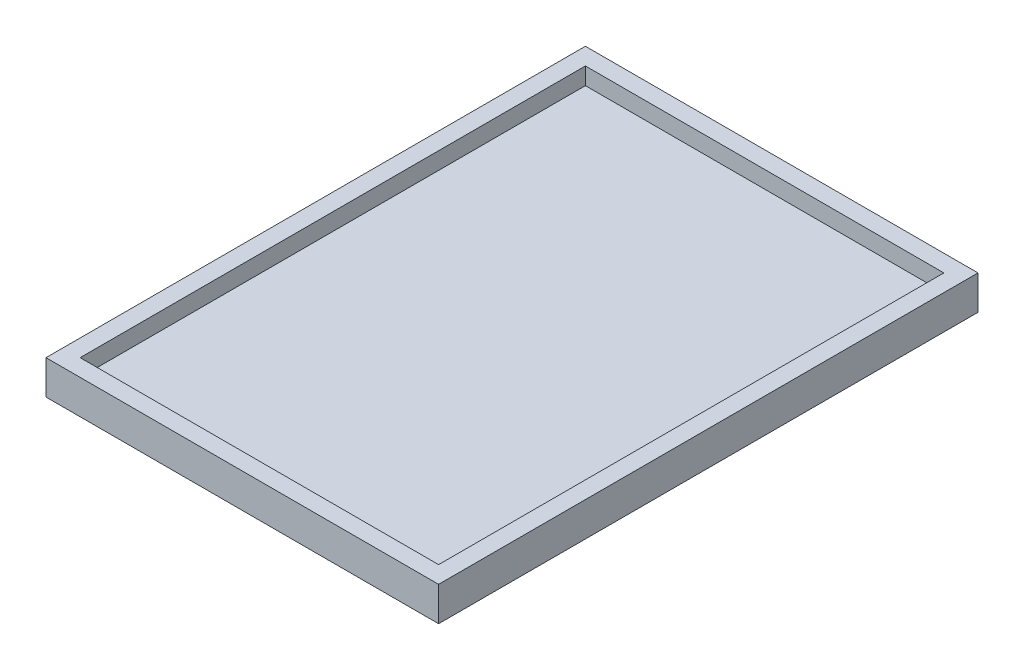
ISO-10303-21;
HEADER;
FILE_DESCRIPTION(('STEP AP214'),'2;1');
FILE_NAME('part.step','',(''),(''),'','','');
FILE_SCHEMA(('AUTOMOTIVE_DESIGN { 1 0 10303 214 1 1 1 1 }'));
ENDSEC;
DATA;
#1=APPLICATION_CONTEXT('core data for automotive mechanical design processes');
#2=APPLICATION_PROTOCOL_DEFINITION('international standard','automotive_design',2000,#1);
#3=PRODUCT_CONTEXT('',#1,'mechanical');
#4=PRODUCT('Part','Part','',(#3));
#5=PRODUCT_RELATED_PRODUCT_CATEGORY('part','',(#4));
#6=PRODUCT_DEFINITION_FORMATION('','',#4);
#7=PRODUCT_DEFINITION_CONTEXT('part definition',#1,'design');
#8=PRODUCT_DEFINITION('design','',#6,#7);
#9=PRODUCT_DEFINITION_SHAPE('','',#8);
#10=(LENGTH_UNIT() NAMED_UNIT(*) SI_UNIT(.MILLI.,.METRE.));
#11=(NAMED_UNIT(*) PLANE_ANGLE_UNIT() SI_UNIT($,.RADIAN.));
#12=(NAMED_UNIT(*) SI_UNIT($,.STERADIAN.) SOLID_ANGLE_UNIT());
#13=UNCERTAINTY_MEASURE_WITH_UNIT(LENGTH_MEASURE(1.E-05),#10,'distance_accuracy_value','');
#14=(GEOMETRIC_REPRESENTATION_CONTEXT(3) GLOBAL_UNCERTAINTY_ASSIGNED_CONTEXT((#13)) GLOBAL_UNIT_ASSIGNED_CONTEXT((#10,
#11,#12)) REPRESENTATION_CONTEXT('',''));
#15=CARTESIAN_POINT('',(0.,0.,0.));
#16=DIRECTION('',(0.,0.,1.));
#17=DIRECTION('',(1.,0.,0.));
#18=AXIS2_PLACEMENT_3D('',#15,#16,#17);
#19=CARTESIAN_POINT('',(0.,10.,0.));
#20=DIRECTION('',(1.,0.,0.));
#21=DIRECTION('',(0.,0.,-1.));
#22=AXIS2_PLACEMENT_3D('',#19,#20,#21);
#23=PLANE('',#22);
#24=DIRECTION('',(0.,0.,1.));
#25=VECTOR('',#24,1.);
#26=CARTESIAN_POINT('',(0.,0.,0.));
#27=LINE('',#26,#25);
#28=CARTESIAN_POINT('',(0.,0.,-158.));
#29=VERTEX_POINT('',#28);
#30=CARTESIAN_POINT('',(0.,0.,0.));
#31=VERTEX_POINT('',#30);
#32=EDGE_CURVE('E142',#29,#31,#27,.T.);
#33=ORIENTED_EDGE('',*,*,#32,.T.);
#34=DIRECTION('',(0.,-1.,0.));
#35=VECTOR('',#34,1.);
#36=CARTESIAN_POINT('',(0.,10.,0.));
#37=LINE('',#36,#35);
#38=CARTESIAN_POINT('',(0.,10.,0.));
#39=VERTEX_POINT('',#38);
#40=EDGE_CURVE('E11',#39,#31,#37,.T.);
#41=ORIENTED_EDGE('',*,*,#40,.F.);
#42=DIRECTION('',(0.,0.,1.));
#43=VECTOR('',#42,1.);
#44=CARTESIAN_POINT('',(0.,10.,0.));
#45=LINE('',#44,#43);
#46=CARTESIAN_POINT('',(0.,10.,-158.));
#47=VERTEX_POINT('',#46);
#48=EDGE_CURVE('E146',#47,#39,#45,.T.);
#49=ORIENTED_EDGE('',*,*,#48,.F.);
#50=DIRECTION('',(0.,-1.,0.));
#51=VECTOR('',#50,1.);
#52=CARTESIAN_POINT('',(0.,10.,-158.));
#53=LINE('',#52,#51);
#54=EDGE_CURVE('E152',#47,#29,#53,.T.);
#55=ORIENTED_EDGE('',*,*,#54,.T.);
#56=EDGE_LOOP('',(#33,#41,#49,#55));
#57=FACE_BOUND('',#56,.T.);
#58=ADVANCED_FACE('F34',(#57),#23,.F.);
#59=CARTESIAN_POINT('',(0.,10.,0.));
#60=DIRECTION('',(0.,0.,-1.));
#61=DIRECTION('',(-1.,0.,0.));
#62=AXIS2_PLACEMENT_3D('',#59,#60,#61);
#63=PLANE('',#62);
#64=DIRECTION('',(1.,0.,0.));
#65=VECTOR('',#64,1.);
#66=CARTESIAN_POINT('',(0.,0.,0.));
#67=LINE('',#66,#65);
#68=CARTESIAN_POINT('',(115.,0.,0.));
#69=VERTEX_POINT('',#68);
#70=EDGE_CURVE('E155',#31,#69,#67,.T.);
#71=ORIENTED_EDGE('',*,*,#70,.T.);
#72=DIRECTION('',(0.,-1.,0.));
#73=VECTOR('',#72,1.);
#74=CARTESIAN_POINT('',(115.,10.,0.));
#75=LINE('',#74,#73);
#76=CARTESIAN_POINT('',(115.,10.,0.));
#77=VERTEX_POINT('',#76);
#78=EDGE_CURVE('E41',#77,#69,#75,.T.);
#79=ORIENTED_EDGE('',*,*,#78,.F.);
#80=DIRECTION('',(1.,0.,0.));
#81=VECTOR('',#80,1.);
#82=CARTESIAN_POINT('',(0.,10.,0.));
#83=LINE('',#82,#81);
#84=EDGE_CURVE('E85',#39,#77,#83,.T.);
#85=ORIENTED_EDGE('',*,*,#84,.F.);
#86=ORIENTED_EDGE('',*,*,#40,.T.);
#87=EDGE_LOOP('',(#71,#79,#85,#86));
#88=FACE_BOUND('',#87,.T.);
#89=ADVANCED_FACE('F184',(#88),#63,.F.);
#90=CARTESIAN_POINT('',(115.,10.,0.));
#91=DIRECTION('',(-1.,0.,0.));
#92=DIRECTION('',(0.,0.,1.));
#93=AXIS2_PLACEMENT_3D('',#90,#91,#92);
#94=PLANE('',#93);
#95=DIRECTION('',(0.,0.,-1.));
#96=VECTOR('',#95,1.);
#97=CARTESIAN_POINT('',(115.,0.,0.));
#98=LINE('',#97,#96);
#99=CARTESIAN_POINT('',(115.,0.,-158.));
#100=VERTEX_POINT('',#99);
#101=EDGE_CURVE('E157',#69,#100,#98,.T.);
#102=ORIENTED_EDGE('',*,*,#101,.T.);
#103=DIRECTION('',(0.,-1.,0.));
#104=VECTOR('',#103,1.);
#105=CARTESIAN_POINT('',(115.,10.,-158.));
#106=LINE('',#105,#104);
#107=CARTESIAN_POINT('',(115.,10.,-158.));
#108=VERTEX_POINT('',#107);
#109=EDGE_CURVE('E161',#108,#100,#106,.T.);
#110=ORIENTED_EDGE('',*,*,#109,.F.);
#111=DIRECTION('',(0.,0.,-1.));
#112=VECTOR('',#111,1.);
#113=CARTESIAN_POINT('',(115.,10.,0.));
#114=LINE('',#113,#112);
#115=EDGE_CURVE('E149',#77,#108,#114,.T.);
#116=ORIENTED_EDGE('',*,*,#115,.F.);
#117=ORIENTED_EDGE('',*,*,#78,.T.);
#118=EDGE_LOOP('',(#102,#110,#116,#117));
#119=FACE_BOUND('',#118,.T.);
#120=ADVANCED_FACE('F166',(#119),#94,.F.);
#121=CARTESIAN_POINT('',(0.,10.,-158.));
#122=DIRECTION('',(0.,0.,1.));
#123=DIRECTION('',(1.,0.,0.));
#124=AXIS2_PLACEMENT_3D('',#121,#122,#123);
#125=PLANE('',#124);
#126=DIRECTION('',(-1.,0.,0.));
#127=VECTOR('',#126,1.);
#128=CARTESIAN_POINT('',(0.,0.,-158.));
#129=LINE('',#128,#127);
#130=EDGE_CURVE('E78',#100,#29,#129,.T.);
#131=ORIENTED_EDGE('',*,*,#130,.T.);
#132=ORIENTED_EDGE('',*,*,#54,.F.);
#133=DIRECTION('',(-1.,0.,0.));
#134=VECTOR('',#133,1.);
#135=CARTESIAN_POINT('',(0.,10.,-158.));
#136=LINE('',#135,#134);
#137=EDGE_CURVE('E57',#108,#47,#136,.T.);
#138=ORIENTED_EDGE('',*,*,#137,.F.);
#139=ORIENTED_EDGE('',*,*,#109,.T.);
#140=EDGE_LOOP('',(#131,#132,#138,#139));
#141=FACE_BOUND('',#140,.T.);
#142=ADVANCED_FACE('F174',(#141),#125,.F.);
#143=CARTESIAN_POINT('',(0.,10.,0.));
#144=DIRECTION('',(0.,-1.,0.));
#145=DIRECTION('',(0.,0.,-1.));
#146=AXIS2_PLACEMENT_3D('',#143,#144,#145);
#147=PLANE('',#146);
#148=DIRECTION('',(1.,0.,0.));
#149=VECTOR('',#148,1.);
#150=CARTESIAN_POINT('',(5.00000000000002,10.,-5.));
#151=LINE('',#150,#149);
#152=CARTESIAN_POINT('',(5.00000000000002,10.,-5.));
#153=VERTEX_POINT('',#152);
#154=CARTESIAN_POINT('',(110.,10.,-5.));
#155=VERTEX_POINT('',#154);
#156=EDGE_CURVE('E136',#153,#155,#151,.T.);
#157=ORIENTED_EDGE('',*,*,#156,.F.);
#158=DIRECTION('',(0.,0.,1.));
#159=VECTOR('',#158,1.);
#160=CARTESIAN_POINT('',(5.,10.,-153.));
#161=LINE('',#160,#159);
#162=CARTESIAN_POINT('',(5.,10.,-153.));
#163=VERTEX_POINT('',#162);
#164=EDGE_CURVE('E48',#163,#153,#161,.T.);
#165=ORIENTED_EDGE('',*,*,#164,.F.);
#166=DIRECTION('',(-1.,0.,0.));
#167=VECTOR('',#166,1.);
#168=CARTESIAN_POINT('',(5.,10.,-153.));
#169=LINE('',#168,#167);
#170=CARTESIAN_POINT('',(110.,10.,-153.));
#171=VERTEX_POINT('',#170);
#172=EDGE_CURVE('E127',#171,#163,#169,.T.);
#173=ORIENTED_EDGE('',*,*,#172,.F.);
#174=DIRECTION('',(0.,0.,-1.));
#175=VECTOR('',#174,1.);
#176=CARTESIAN_POINT('',(110.,10.,-153.));
#177=LINE('',#176,#175);
#178=EDGE_CURVE('E130',#155,#171,#177,.T.);
#179=ORIENTED_EDGE('',*,*,#178,.F.);
#180=EDGE_LOOP('',(#157,#165,#173,#179));
#181=FACE_BOUND('',#180,.T.);
#182=ORIENTED_EDGE('',*,*,#48,.T.);
#183=ORIENTED_EDGE('',*,*,#84,.T.);
#184=ORIENTED_EDGE('',*,*,#115,.T.);
#185=ORIENTED_EDGE('',*,*,#137,.T.);
#186=EDGE_LOOP('',(#182,#183,#184,#185));
#187=FACE_BOUND('',#186,.T.);
#188=ADVANCED_FACE('F176',(#181,#187),#147,.F.);
#189=CARTESIAN_POINT('',(0.,0.,0.));
#190=DIRECTION('',(0.,-1.,0.));
#191=DIRECTION('',(0.,0.,-1.));
#192=AXIS2_PLACEMENT_3D('',#189,#190,#191);
#193=PLANE('',#192);
#194=ORIENTED_EDGE('',*,*,#32,.F.);
#195=ORIENTED_EDGE('',*,*,#130,.F.);
#196=ORIENTED_EDGE('',*,*,#101,.F.);
#197=ORIENTED_EDGE('',*,*,#70,.F.);
#198=EDGE_LOOP('',(#194,#195,#196,#197));
#199=FACE_BOUND('',#198,.T.);
#200=ADVANCED_FACE('F170',(#199),#193,.T.);
#201=CARTESIAN_POINT('',(5.,5.,-153.));
#202=DIRECTION('',(-1.,0.,0.));
#203=DIRECTION('',(0.,0.,1.));
#204=AXIS2_PLACEMENT_3D('',#201,#202,#203);
#205=PLANE('',#204);
#206=ORIENTED_EDGE('',*,*,#164,.T.);
#207=DIRECTION('',(0.,1.,0.));
#208=VECTOR('',#207,1.);
#209=CARTESIAN_POINT('',(5.00000000000002,5.,-5.));
#210=LINE('',#209,#208);
#211=CARTESIAN_POINT('',(5.00000000000002,5.,-5.));
#212=VERTEX_POINT('',#211);
#213=EDGE_CURVE('E105',#212,#153,#210,.T.);
#214=ORIENTED_EDGE('',*,*,#213,.F.);
#215=DIRECTION('',(0.,0.,1.));
#216=VECTOR('',#215,1.);
#217=CARTESIAN_POINT('',(5.,5.,-153.));
#218=LINE('',#217,#216);
#219=CARTESIAN_POINT('',(5.,5.,-153.));
#220=VERTEX_POINT('',#219);
#221=EDGE_CURVE('E109',#220,#212,#218,.T.);
#222=ORIENTED_EDGE('',*,*,#221,.F.);
#223=DIRECTION('',(0.,1.,0.));
#224=VECTOR('',#223,1.);
#225=CARTESIAN_POINT('',(5.,5.,-153.));
#226=LINE('',#225,#224);
#227=EDGE_CURVE('E140',#220,#163,#226,.T.);
#228=ORIENTED_EDGE('',*,*,#227,.T.);
#229=EDGE_LOOP('',(#206,#214,#222,#228));
#230=FACE_BOUND('',#229,.T.);
#231=ADVANCED_FACE('F107',(#230),#205,.F.);
#232=CARTESIAN_POINT('',(5.,5.,-153.));
#233=DIRECTION('',(0.,0.,-1.));
#234=DIRECTION('',(-1.,0.,0.));
#235=AXIS2_PLACEMENT_3D('',#232,#233,#234);
#236=PLANE('',#235);
#237=ORIENTED_EDGE('',*,*,#172,.T.);
#238=ORIENTED_EDGE('',*,*,#227,.F.);
#239=DIRECTION('',(-1.,0.,0.));
#240=VECTOR('',#239,1.);
#241=CARTESIAN_POINT('',(5.,5.,-153.));
#242=LINE('',#241,#240);
#243=CARTESIAN_POINT('',(110.,5.,-153.));
#244=VERTEX_POINT('',#243);
#245=EDGE_CURVE('E115',#244,#220,#242,.T.);
#246=ORIENTED_EDGE('',*,*,#245,.F.);
#247=DIRECTION('',(0.,1.,0.));
#248=VECTOR('',#247,1.);
#249=CARTESIAN_POINT('',(110.,5.,-153.));
#250=LINE('',#249,#248);
#251=EDGE_CURVE('E143',#244,#171,#250,.T.);
#252=ORIENTED_EDGE('',*,*,#251,.T.);
#253=EDGE_LOOP('',(#237,#238,#246,#252));
#254=FACE_BOUND('',#253,.T.);
#255=ADVANCED_FACE('F223',(#254),#236,.F.);
#256=CARTESIAN_POINT('',(110.,5.,-153.));
#257=DIRECTION('',(1.,0.,0.));
#258=DIRECTION('',(0.,0.,-1.));
#259=AXIS2_PLACEMENT_3D('',#256,#257,#258);
#260=PLANE('',#259);
#261=ORIENTED_EDGE('',*,*,#178,.T.);
#262=ORIENTED_EDGE('',*,*,#251,.F.);
#263=DIRECTION('',(0.,0.,-1.));
#264=VECTOR('',#263,1.);
#265=CARTESIAN_POINT('',(110.,5.,-153.));
#266=LINE('',#265,#264);
#267=CARTESIAN_POINT('',(110.,5.,-5.));
#268=VERTEX_POINT('',#267);
#269=EDGE_CURVE('E123',#268,#244,#266,.T.);
#270=ORIENTED_EDGE('',*,*,#269,.F.);
#271=DIRECTION('',(0.,1.,0.));
#272=VECTOR('',#271,1.);
#273=CARTESIAN_POINT('',(110.,5.,-5.));
#274=LINE('',#273,#272);
#275=EDGE_CURVE('E114',#268,#155,#274,.T.);
#276=ORIENTED_EDGE('',*,*,#275,.T.);
#277=EDGE_LOOP('',(#261,#262,#270,#276));
#278=FACE_BOUND('',#277,.T.);
#279=ADVANCED_FACE('F232',(#278),#260,.F.);
#280=CARTESIAN_POINT('',(5.00000000000002,5.,-5.));
#281=DIRECTION('',(0.,0.,1.));
#282=DIRECTION('',(1.,0.,0.));
#283=AXIS2_PLACEMENT_3D('',#280,#281,#282);
#284=PLANE('',#283);
#285=ORIENTED_EDGE('',*,*,#156,.T.);
#286=ORIENTED_EDGE('',*,*,#275,.F.);
#287=DIRECTION('',(1.,0.,0.));
#288=VECTOR('',#287,1.);
#289=CARTESIAN_POINT('',(5.00000000000002,5.,-5.));
#290=LINE('',#289,#288);
#291=EDGE_CURVE('E118',#212,#268,#290,.T.);
#292=ORIENTED_EDGE('',*,*,#291,.F.);
#293=ORIENTED_EDGE('',*,*,#213,.T.);
#294=EDGE_LOOP('',(#285,#286,#292,#293));
#295=FACE_BOUND('',#294,.T.);
#296=ADVANCED_FACE('F119',(#295),#284,.F.);
#297=CARTESIAN_POINT('',(0.,5.,0.));
#298=DIRECTION('',(0.,1.,0.));
#299=DIRECTION('',(0.,0.,1.));
#300=AXIS2_PLACEMENT_3D('',#297,#298,#299);
#301=PLANE('',#300);
#302=ORIENTED_EDGE('',*,*,#221,.T.);
#303=ORIENTED_EDGE('',*,*,#291,.T.);
#304=ORIENTED_EDGE('',*,*,#269,.T.);
#305=ORIENTED_EDGE('',*,*,#245,.T.);
#306=EDGE_LOOP('',(#302,#303,#304,#305));
#307=FACE_BOUND('',#306,.T.);
#308=ADVANCED_FACE('F125',(#307),#301,.T.);
#309=CLOSED_SHELL('',(#58,#89,#120,#142,#188,#200,#231,#255,#279,#296,#308));
#310=MANIFOLD_SOLID_BREP('B2',#309);
#311=ADVANCED_BREP_SHAPE_REPRESENTATION('',(#18,#310),#14);
#312=SHAPE_DEFINITION_REPRESENTATION(#9,#311);
ENDSEC;
END-ISO-10303-21;
